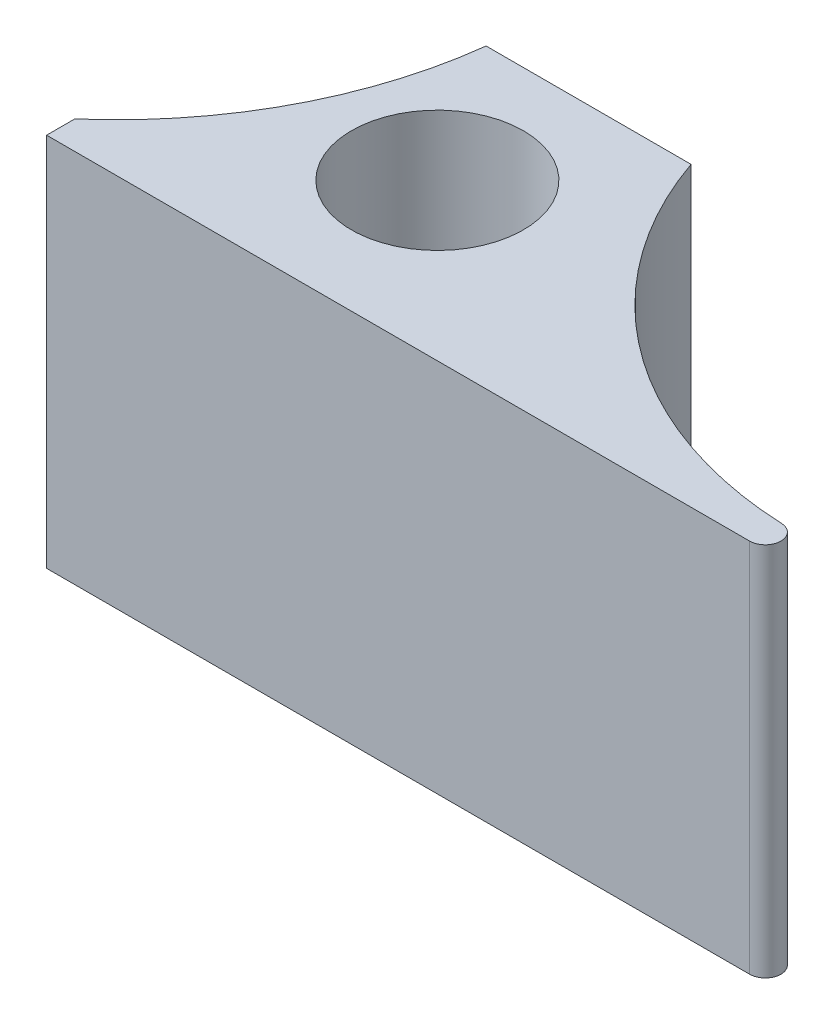
ISO-10303-21;
HEADER;
FILE_DESCRIPTION(('STEP AP214'),'2;1');
FILE_NAME('part.step','',(''),(''),'','','');
FILE_SCHEMA(('AUTOMOTIVE_DESIGN { 1 0 10303 214 1 1 1 1 }'));
ENDSEC;
DATA;
#1=APPLICATION_CONTEXT('core data for automotive mechanical design processes');
#2=APPLICATION_PROTOCOL_DEFINITION('international standard','automotive_design',2000,#1);
#3=PRODUCT_CONTEXT('',#1,'mechanical');
#4=PRODUCT('Part','Part','',(#3));
#5=PRODUCT_RELATED_PRODUCT_CATEGORY('part','',(#4));
#6=PRODUCT_DEFINITION_FORMATION('','',#4);
#7=PRODUCT_DEFINITION_CONTEXT('part definition',#1,'design');
#8=PRODUCT_DEFINITION('design','',#6,#7);
#9=PRODUCT_DEFINITION_SHAPE('','',#8);
#10=(LENGTH_UNIT() NAMED_UNIT(*) SI_UNIT(.MILLI.,.METRE.));
#11=(NAMED_UNIT(*) PLANE_ANGLE_UNIT() SI_UNIT($,.RADIAN.));
#12=(NAMED_UNIT(*) SI_UNIT($,.STERADIAN.) SOLID_ANGLE_UNIT());
#13=UNCERTAINTY_MEASURE_WITH_UNIT(LENGTH_MEASURE(1.E-05),#10,'distance_accuracy_value','');
#14=(GEOMETRIC_REPRESENTATION_CONTEXT(3) GLOBAL_UNCERTAINTY_ASSIGNED_CONTEXT((#13)) GLOBAL_UNIT_ASSIGNED_CONTEXT((#10,
#11,#12)) REPRESENTATION_CONTEXT('',''));
#15=CARTESIAN_POINT('',(0.,0.,0.));
#16=DIRECTION('',(0.,0.,1.));
#17=DIRECTION('',(1.,0.,0.));
#18=AXIS2_PLACEMENT_3D('',#15,#16,#17);
#19=CARTESIAN_POINT('',(68.0882651486597,12.,-34.5099999999994));
#20=DIRECTION('',(0.,0.,-1.));
#21=DIRECTION('',(-1.,0.,0.));
#22=AXIS2_PLACEMENT_3D('',#19,#20,#21);
#23=PLANE('',#22);
#24=DIRECTION('',(1.,0.,0.));
#25=VECTOR('',#24,1.);
#26=CARTESIAN_POINT('',(67.4059138299012,12.,-34.5099999999994));
#27=LINE('',#26,#25);
#28=CARTESIAN_POINT('',(54.9784761685791,12.,-34.5099999999994));
#29=VERTEX_POINT('',#28);
#30=CARTESIAN_POINT('',(68.0882651486597,12.,-34.5099999999993));
#31=VERTEX_POINT('',#30);
#32=EDGE_CURVE('E106',#29,#31,#27,.T.);
#33=ORIENTED_EDGE('',*,*,#32,.T.);
#34=DIRECTION('',(0.,-1.,0.));
#35=VECTOR('',#34,1.);
#36=CARTESIAN_POINT('',(68.0882651486597,12.,-34.5099999999993));
#37=LINE('',#36,#35);
#38=CARTESIAN_POINT('',(68.0882651486597,-12.,-34.5099999999993));
#39=VERTEX_POINT('',#38);
#40=EDGE_CURVE('E97',#31,#39,#37,.T.);
#41=ORIENTED_EDGE('',*,*,#40,.T.);
#42=DIRECTION('',(1.,0.,0.));
#43=VECTOR('',#42,1.);
#44=CARTESIAN_POINT('',(67.4059138299012,-12.,-34.5099999999994));
#45=LINE('',#44,#43);
#46=CARTESIAN_POINT('',(54.9784761685791,-12.,-34.5099999999994));
#47=VERTEX_POINT('',#46);
#48=EDGE_CURVE('E76',#47,#39,#45,.T.);
#49=ORIENTED_EDGE('',*,*,#48,.F.);
#50=DIRECTION('',(0.,-1.,0.));
#51=VECTOR('',#50,1.);
#52=CARTESIAN_POINT('',(54.9784761685791,12.,-34.5099999999994));
#53=LINE('',#52,#51);
#54=EDGE_CURVE('E72',#47,#29,#53,.F.);
#55=ORIENTED_EDGE('',*,*,#54,.T.);
#56=EDGE_LOOP('',(#33,#41,#49,#55));
#57=FACE_BOUND('',#56,.T.);
#58=ADVANCED_FACE('F16',(#57),#23,.T.);
#59=CARTESIAN_POINT('',(92.0034583156718,12.,-42.7932049204646));
#60=DIRECTION('',(0.,-1.,0.));
#61=DIRECTION('',(0.,0.,-1.));
#62=AXIS2_PLACEMENT_3D('',#59,#60,#61);
#63=CYLINDRICAL_SURFACE('',#62,25.309048736962);
#64=ORIENTED_EDGE('',*,*,#40,.F.);
#65=CARTESIAN_POINT('',(92.0034583156718,12.,-42.7932049204646));
#66=DIRECTION('',(0.,-1.,0.));
#67=DIRECTION('',(0.,0.,-1.));
#68=AXIS2_PLACEMENT_3D('',#65,#66,#67);
#69=CIRCLE('',#68,25.309048736962);
#70=CARTESIAN_POINT('',(90.881930906888,12.,-17.509017683354));
#71=VERTEX_POINT('',#70);
#72=EDGE_CURVE('E104',#31,#71,#69,.F.);
#73=ORIENTED_EDGE('',*,*,#72,.T.);
#74=DIRECTION('',(0.,-1.,0.));
#75=VECTOR('',#74,1.);
#76=CARTESIAN_POINT('',(90.8819309068879,12.,-17.5090176833541));
#77=LINE('',#76,#75);
#78=CARTESIAN_POINT('',(90.881930906888,-12.,-17.509017683354));
#79=VERTEX_POINT('',#78);
#80=EDGE_CURVE('E92',#79,#71,#77,.F.);
#81=ORIENTED_EDGE('',*,*,#80,.F.);
#82=CARTESIAN_POINT('',(92.0034583156718,-12.,-42.7932049204646));
#83=DIRECTION('',(0.,-1.,0.));
#84=DIRECTION('',(0.,0.,-1.));
#85=AXIS2_PLACEMENT_3D('',#82,#83,#84);
#86=CIRCLE('',#85,25.309048736962);
#87=EDGE_CURVE('E112',#39,#79,#86,.F.);
#88=ORIENTED_EDGE('',*,*,#87,.F.);
#89=EDGE_LOOP('',(#64,#73,#81,#88));
#90=FACE_BOUND('',#89,.T.);
#91=ADVANCED_FACE('F125',(#90),#63,.F.);
#92=CARTESIAN_POINT('',(60.86,0.,-25.51));
#93=DIRECTION('',(0.,-1.,0.));
#94=DIRECTION('',(0.,0.,-1.));
#95=AXIS2_PLACEMENT_3D('',#92,#93,#94);
#96=CYLINDRICAL_SURFACE('',#95,5.5);
#97=CARTESIAN_POINT('',(60.86,-12.,-25.51));
#98=DIRECTION('',(0.,-1.,0.));
#99=DIRECTION('',(0.,0.,-1.));
#100=AXIS2_PLACEMENT_3D('',#97,#98,#99);
#101=CIRCLE('',#100,5.5);
#102=CARTESIAN_POINT('',(60.86,-12.,-31.01));
#103=VERTEX_POINT('',#102);
#104=EDGE_CURVE('E110',#103,#103,#101,.F.);
#105=ORIENTED_EDGE('',*,*,#104,.F.);
#106=EDGE_LOOP('',(#105));
#107=FACE_BOUND('',#106,.T.);
#108=CARTESIAN_POINT('',(60.86,12.,-25.51));
#109=DIRECTION('',(0.,-1.,0.));
#110=DIRECTION('',(0.,0.,-1.));
#111=AXIS2_PLACEMENT_3D('',#108,#109,#110);
#112=CIRCLE('',#111,5.5);
#113=CARTESIAN_POINT('',(60.86,12.,-31.01));
#114=VERTEX_POINT('',#113);
#115=EDGE_CURVE('E83',#114,#114,#112,.F.);
#116=ORIENTED_EDGE('',*,*,#115,.T.);
#117=EDGE_LOOP('',(#116));
#118=FACE_BOUND('',#117,.T.);
#119=ADVANCED_FACE('F151',(#107,#118),#96,.F.);
#120=CARTESIAN_POINT('',(28.1610771766908,12.,-37.7128039816621));
#121=DIRECTION('',(0.,-1.,0.));
#122=DIRECTION('',(0.,0.,-1.));
#123=AXIS2_PLACEMENT_3D('',#120,#121,#122);
#124=CYLINDRICAL_SURFACE('',#123,27.0079773777135);
#125=DIRECTION('',(0.,1.,0.));
#126=VECTOR('',#125,1.);
#127=CARTESIAN_POINT('',(45.86,12.,-17.3123389641771));
#128=LINE('',#127,#126);
#129=CARTESIAN_POINT('',(45.86,12.,-17.3123389641771));
#130=VERTEX_POINT('',#129);
#131=CARTESIAN_POINT('',(45.86,-12.,-17.3123389641771));
#132=VERTEX_POINT('',#131);
#133=EDGE_CURVE('E71',#130,#132,#128,.F.);
#134=ORIENTED_EDGE('',*,*,#133,.F.);
#135=CARTESIAN_POINT('',(28.1610771766908,12.,-37.7128039816621));
#136=DIRECTION('',(0.,-1.,0.));
#137=DIRECTION('',(0.,0.,-1.));
#138=AXIS2_PLACEMENT_3D('',#135,#136,#137);
#139=CIRCLE('',#138,27.0079773777135);
#140=EDGE_CURVE('E95',#130,#29,#139,.F.);
#141=ORIENTED_EDGE('',*,*,#140,.T.);
#142=ORIENTED_EDGE('',*,*,#54,.F.);
#143=CARTESIAN_POINT('',(28.1610771766908,-12.,-37.7128039816621));
#144=DIRECTION('',(0.,-1.,0.));
#145=DIRECTION('',(0.,0.,-1.));
#146=AXIS2_PLACEMENT_3D('',#143,#144,#145);
#147=CIRCLE('',#146,27.0079773777135);
#148=EDGE_CURVE('E19',#132,#47,#147,.F.);
#149=ORIENTED_EDGE('',*,*,#148,.F.);
#150=EDGE_LOOP('',(#134,#141,#142,#149));
#151=FACE_BOUND('',#150,.T.);
#152=ADVANCED_FACE('F68',(#151),#124,.F.);
#153=CARTESIAN_POINT('',(67.4059138299012,-12.,-21.7389438228754));
#154=DIRECTION('',(0.,-1.,0.));
#155=DIRECTION('',(0.,0.,-1.));
#156=AXIS2_PLACEMENT_3D('',#153,#154,#155);
#157=PLANE('',#156);
#158=ORIENTED_EDGE('',*,*,#104,.T.);
#159=EDGE_LOOP('',(#158));
#160=FACE_BOUND('',#159,.T.);
#161=ORIENTED_EDGE('',*,*,#87,.T.);
#162=CARTESIAN_POINT('',(90.8376176092829,-12.,-16.5099999999993));
#163=DIRECTION('',(0.,-1.,0.));
#164=DIRECTION('',(0.,0.,-1.));
#165=AXIS2_PLACEMENT_3D('',#162,#163,#164);
#166=CIRCLE('',#165,1.00000000000002);
#167=CARTESIAN_POINT('',(90.8376176092829,-12.,-15.51));
#168=VERTEX_POINT('',#167);
#169=EDGE_CURVE('E96',#168,#79,#166,.F.);
#170=ORIENTED_EDGE('',*,*,#169,.F.);
#171=DIRECTION('',(1.,0.,0.));
#172=VECTOR('',#171,1.);
#173=CARTESIAN_POINT('',(45.86,-12.,-15.51));
#174=LINE('',#173,#172);
#175=CARTESIAN_POINT('',(45.86,-12.,-15.5099999999999));
#176=VERTEX_POINT('',#175);
#177=EDGE_CURVE('E81',#176,#168,#174,.T.);
#178=ORIENTED_EDGE('',*,*,#177,.F.);
#179=DIRECTION('',(0.,0.,1.));
#180=VECTOR('',#179,1.);
#181=CARTESIAN_POINT('',(45.86,-12.,-16.7722129543641));
#182=LINE('',#181,#180);
#183=EDGE_CURVE('E78',#132,#176,#182,.T.);
#184=ORIENTED_EDGE('',*,*,#183,.F.);
#185=ORIENTED_EDGE('',*,*,#148,.T.);
#186=ORIENTED_EDGE('',*,*,#48,.T.);
#187=EDGE_LOOP('',(#161,#170,#178,#184,#185,#186));
#188=FACE_BOUND('',#187,.T.);
#189=ADVANCED_FACE('F79',(#160,#188),#157,.T.);
#190=CARTESIAN_POINT('',(90.8376176092829,12.,-16.5099999999993));
#191=DIRECTION('',(0.,-1.,0.));
#192=DIRECTION('',(0.,0.,-1.));
#193=AXIS2_PLACEMENT_3D('',#190,#191,#192);
#194=CYLINDRICAL_SURFACE('',#193,1.00000000000002);
#195=CARTESIAN_POINT('',(90.8376176092829,12.,-16.5099999999993));
#196=DIRECTION('',(0.,-1.,0.));
#197=DIRECTION('',(0.,0.,-1.));
#198=AXIS2_PLACEMENT_3D('',#195,#196,#197);
#199=CIRCLE('',#198,1.00000000000002);
#200=CARTESIAN_POINT('',(90.8376176092829,12.,-15.51));
#201=VERTEX_POINT('',#200);
#202=EDGE_CURVE('E102',#71,#201,#199,.T.);
#203=ORIENTED_EDGE('',*,*,#202,.T.);
#204=DIRECTION('',(0.,1.,0.));
#205=VECTOR('',#204,1.);
#206=CARTESIAN_POINT('',(90.8376176092828,12.,-15.51));
#207=LINE('',#206,#205);
#208=EDGE_CURVE('E87',#168,#201,#207,.T.);
#209=ORIENTED_EDGE('',*,*,#208,.F.);
#210=ORIENTED_EDGE('',*,*,#169,.T.);
#211=ORIENTED_EDGE('',*,*,#80,.T.);
#212=EDGE_LOOP('',(#203,#209,#210,#211));
#213=FACE_BOUND('',#212,.T.);
#214=ADVANCED_FACE('F130',(#213),#194,.T.);
#215=CARTESIAN_POINT('',(67.4059138299012,12.,-21.7389438228754));
#216=DIRECTION('',(0.,-1.,0.));
#217=DIRECTION('',(0.,0.,-1.));
#218=AXIS2_PLACEMENT_3D('',#215,#216,#217);
#219=PLANE('',#218);
#220=ORIENTED_EDGE('',*,*,#115,.F.);
#221=EDGE_LOOP('',(#220));
#222=FACE_BOUND('',#221,.T.);
#223=DIRECTION('',(1.,0.,0.));
#224=VECTOR('',#223,1.);
#225=CARTESIAN_POINT('',(45.86,12.,-15.51));
#226=LINE('',#225,#224);
#227=CARTESIAN_POINT('',(45.86,12.,-15.5099999999999));
#228=VERTEX_POINT('',#227);
#229=EDGE_CURVE('E25',#201,#228,#226,.F.);
#230=ORIENTED_EDGE('',*,*,#229,.F.);
#231=ORIENTED_EDGE('',*,*,#202,.F.);
#232=ORIENTED_EDGE('',*,*,#72,.F.);
#233=ORIENTED_EDGE('',*,*,#32,.F.);
#234=ORIENTED_EDGE('',*,*,#140,.F.);
#235=DIRECTION('',(0.,0.,1.));
#236=VECTOR('',#235,1.);
#237=CARTESIAN_POINT('',(45.86,12.,-16.7722129543641));
#238=LINE('',#237,#236);
#239=EDGE_CURVE('E34',#228,#130,#238,.F.);
#240=ORIENTED_EDGE('',*,*,#239,.F.);
#241=EDGE_LOOP('',(#230,#231,#232,#233,#234,#240));
#242=FACE_BOUND('',#241,.T.);
#243=ADVANCED_FACE('F127',(#222,#242),#219,.F.);
#244=CARTESIAN_POINT('',(45.86,12.,-16.7722129543641));
#245=DIRECTION('',(-1.,0.,0.));
#246=DIRECTION('',(0.,0.,1.));
#247=AXIS2_PLACEMENT_3D('',#244,#245,#246);
#248=PLANE('',#247);
#249=ORIENTED_EDGE('',*,*,#239,.T.);
#250=ORIENTED_EDGE('',*,*,#133,.T.);
#251=ORIENTED_EDGE('',*,*,#183,.T.);
#252=DIRECTION('',(0.,1.,0.));
#253=VECTOR('',#252,1.);
#254=CARTESIAN_POINT('',(45.86,12.,-15.51));
#255=LINE('',#254,#253);
#256=EDGE_CURVE('E11',#228,#176,#255,.F.);
#257=ORIENTED_EDGE('',*,*,#256,.F.);
#258=EDGE_LOOP('',(#249,#250,#251,#257));
#259=FACE_BOUND('',#258,.T.);
#260=ADVANCED_FACE('F85',(#259),#248,.T.);
#261=CARTESIAN_POINT('',(45.86,12.,-15.51));
#262=DIRECTION('',(0.,0.,1.));
#263=DIRECTION('',(1.,0.,0.));
#264=AXIS2_PLACEMENT_3D('',#261,#262,#263);
#265=PLANE('',#264);
#266=ORIENTED_EDGE('',*,*,#229,.T.);
#267=ORIENTED_EDGE('',*,*,#256,.T.);
#268=ORIENTED_EDGE('',*,*,#177,.T.);
#269=ORIENTED_EDGE('',*,*,#208,.T.);
#270=EDGE_LOOP('',(#266,#267,#268,#269));
#271=FACE_BOUND('',#270,.T.);
#272=ADVANCED_FACE('F132',(#271),#265,.T.);
#273=CLOSED_SHELL('',(#58,#91,#119,#152,#189,#214,#243,#260,#272));
#274=MANIFOLD_SOLID_BREP('B1',#273);
#275=ADVANCED_BREP_SHAPE_REPRESENTATION('',(#18,#274),#14);
#276=SHAPE_DEFINITION_REPRESENTATION(#9,#275);
ENDSEC;
END-ISO-10303-21;
